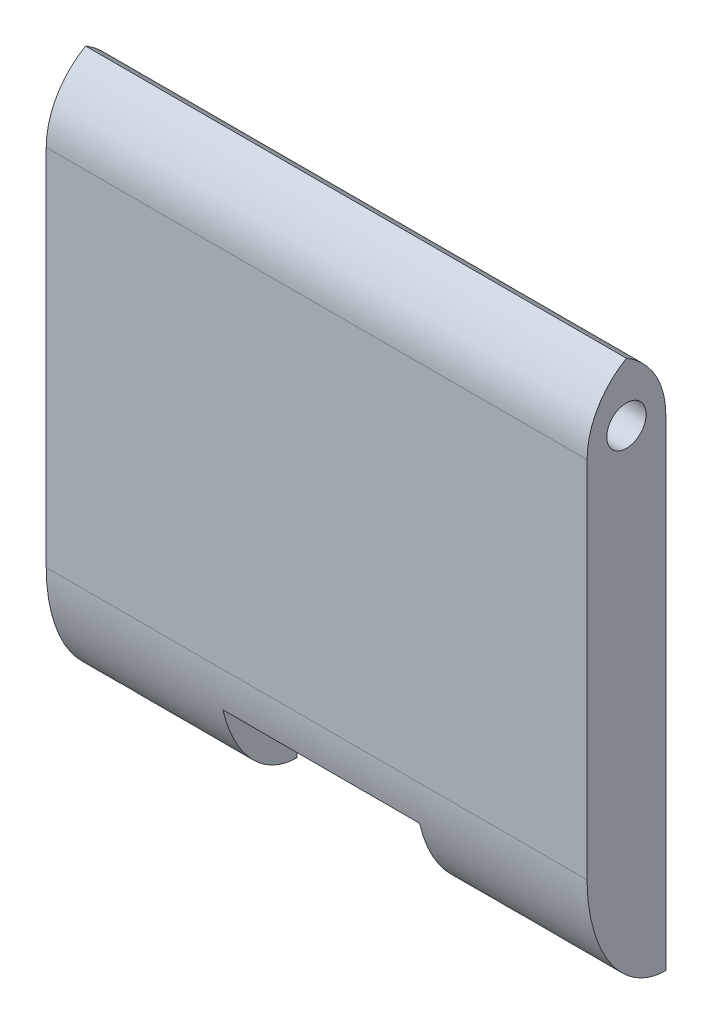
ISO-10303-21;
HEADER;
FILE_DESCRIPTION(('STEP AP214'),'2;1');
FILE_NAME('part.step','',(''),(''),'','','');
FILE_SCHEMA(('AUTOMOTIVE_DESIGN { 1 0 10303 214 1 1 1 1 }'));
ENDSEC;
DATA;
#1=APPLICATION_CONTEXT('core data for automotive mechanical design processes');
#2=APPLICATION_PROTOCOL_DEFINITION('international standard','automotive_design',2000,#1);
#3=PRODUCT_CONTEXT('',#1,'mechanical');
#4=PRODUCT('Part','Part','',(#3));
#5=PRODUCT_RELATED_PRODUCT_CATEGORY('part','',(#4));
#6=PRODUCT_DEFINITION_FORMATION('','',#4);
#7=PRODUCT_DEFINITION_CONTEXT('part definition',#1,'design');
#8=PRODUCT_DEFINITION('design','',#6,#7);
#9=PRODUCT_DEFINITION_SHAPE('','',#8);
#10=(LENGTH_UNIT() NAMED_UNIT(*) SI_UNIT(.MILLI.,.METRE.));
#11=(NAMED_UNIT(*) PLANE_ANGLE_UNIT() SI_UNIT($,.RADIAN.));
#12=(NAMED_UNIT(*) SI_UNIT($,.STERADIAN.) SOLID_ANGLE_UNIT());
#13=UNCERTAINTY_MEASURE_WITH_UNIT(LENGTH_MEASURE(1.E-05),#10,'distance_accuracy_value','');
#14=(GEOMETRIC_REPRESENTATION_CONTEXT(3) GLOBAL_UNCERTAINTY_ASSIGNED_CONTEXT((#13)) GLOBAL_UNIT_ASSIGNED_CONTEXT((#10,
#11,#12)) REPRESENTATION_CONTEXT('',''));
#15=CARTESIAN_POINT('',(0.,0.,0.));
#16=DIRECTION('',(0.,0.,1.));
#17=DIRECTION('',(1.,0.,0.));
#18=AXIS2_PLACEMENT_3D('',#15,#16,#17);
#19=CARTESIAN_POINT('',(10.,0.,8.));
#20=DIRECTION('',(-1.,0.,0.));
#21=DIRECTION('',(0.,0.,1.));
#22=AXIS2_PLACEMENT_3D('',#19,#20,#21);
#23=PLANE('',#22);
#24=DIRECTION('',(0.,1.,0.));
#25=VECTOR('',#24,1.);
#26=CARTESIAN_POINT('',(10.,0.,0.));
#27=LINE('',#26,#25);
#28=CARTESIAN_POINT('',(10.,-28.5,0.));
#29=VERTEX_POINT('',#28);
#30=CARTESIAN_POINT('',(10.,-20.5,0.));
#31=VERTEX_POINT('',#30);
#32=EDGE_CURVE('E126',#29,#31,#27,.T.);
#33=ORIENTED_EDGE('',*,*,#32,.F.);
#34=CARTESIAN_POINT('',(10.,-16.5,8.));
#35=CARTESIAN_POINT('',(10.,-28.5,8.));
#36=CARTESIAN_POINT('',(10.,-28.5,0.));
#37=(BOUNDED_CURVE() B_SPLINE_CURVE(2,(#34,#35,#36),.UNSPECIFIED.,.F.,
.F.) B_SPLINE_CURVE_WITH_KNOTS((3,3),(0.,1.),
.UNSPECIFIED.) CURVE() GEOMETRIC_REPRESENTATION_ITEM() RATIONAL_B_SPLINE_CURVE((1.,
0.707106781186548,1.)) REPRESENTATION_ITEM(''));
#38=CARTESIAN_POINT('',(10.,-20.5,7.54247233265651));
#39=VERTEX_POINT('',#38);
#40=EDGE_CURVE('E77',#29,#39,#37,.F.);
#41=ORIENTED_EDGE('',*,*,#40,.T.);
#42=DIRECTION('',(0.,0.,-1.));
#43=VECTOR('',#42,1.);
#44=CARTESIAN_POINT('',(10.,-20.5,8.));
#45=LINE('',#44,#43);
#46=EDGE_CURVE('E135',#39,#31,#45,.T.);
#47=ORIENTED_EDGE('',*,*,#46,.T.);
#48=EDGE_LOOP('',(#33,#41,#47));
#49=FACE_BOUND('',#48,.T.);
#50=ADVANCED_FACE('F46',(#49),#23,.T.);
#51=CARTESIAN_POINT('',(27.5,0.,8.));
#52=DIRECTION('',(-1.,0.,0.));
#53=DIRECTION('',(0.,0.,1.));
#54=AXIS2_PLACEMENT_3D('',#51,#52,#53);
#55=PLANE('',#54);
#56=CARTESIAN_POINT('',(27.5,21.5,4.));
#57=DIRECTION('',(1.,0.,0.));
#58=DIRECTION('',(0.,0.,-1.));
#59=AXIS2_PLACEMENT_3D('',#56,#57,#58);
#60=CIRCLE('',#59,2.);
#61=CARTESIAN_POINT('',(27.5,21.5,2.));
#62=VERTEX_POINT('',#61);
#63=EDGE_CURVE('E445',#62,#62,#60,.T.);
#64=ORIENTED_EDGE('',*,*,#63,.F.);
#65=EDGE_LOOP('',(#64));
#66=FACE_BOUND('',#65,.T.);
#67=DIRECTION('',(0.,1.,0.));
#68=VECTOR('',#67,1.);
#69=CARTESIAN_POINT('',(27.5,0.,8.));
#70=LINE('',#69,#68);
#71=CARTESIAN_POINT('',(27.5,-16.5,8.));
#72=VERTEX_POINT('',#71);
#73=CARTESIAN_POINT('',(27.5,20.5,8.));
#74=VERTEX_POINT('',#73);
#75=EDGE_CURVE('E209',#72,#74,#70,.T.);
#76=ORIENTED_EDGE('',*,*,#75,.F.);
#77=CARTESIAN_POINT('',(27.5,-28.5,0.));
#78=CARTESIAN_POINT('',(27.5,-28.5,8.));
#79=CARTESIAN_POINT('',(27.5,-16.5,8.));
#80=(BOUNDED_CURVE() B_SPLINE_CURVE(2,(#77,#78,#79),.UNSPECIFIED.,.F.,
.F.) B_SPLINE_CURVE_WITH_KNOTS((3,3),(0.,1.),
.UNSPECIFIED.) CURVE() GEOMETRIC_REPRESENTATION_ITEM() RATIONAL_B_SPLINE_CURVE((1.,
0.707106781186548,1.)) REPRESENTATION_ITEM(''));
#81=CARTESIAN_POINT('',(27.5,-28.5,0.));
#82=VERTEX_POINT('',#81);
#83=EDGE_CURVE('E144',#72,#82,#80,.F.);
#84=ORIENTED_EDGE('',*,*,#83,.T.);
#85=DIRECTION('',(0.,1.,0.));
#86=VECTOR('',#85,1.);
#87=CARTESIAN_POINT('',(27.5,0.,0.));
#88=LINE('',#87,#86);
#89=CARTESIAN_POINT('',(27.5,20.5,0.));
#90=VERTEX_POINT('',#89);
#91=EDGE_CURVE('E128',#82,#90,#88,.T.);
#92=ORIENTED_EDGE('',*,*,#91,.T.);
#93=CARTESIAN_POINT('',(27.5,20.5,8.));
#94=DIRECTION('',(-1.,0.,0.));
#95=DIRECTION('',(0.,0.,1.));
#96=AXIS2_PLACEMENT_3D('',#93,#94,#95);
#97=CIRCLE('',#96,8.);
#98=CARTESIAN_POINT('',(27.5,27.4282032302755,4.));
#99=VERTEX_POINT('',#98);
#100=EDGE_CURVE('E269',#90,#99,#97,.F.);
#101=ORIENTED_EDGE('',*,*,#100,.T.);
#102=CARTESIAN_POINT('',(27.5,20.5,0.));
#103=DIRECTION('',(-1.,0.,0.));
#104=DIRECTION('',(0.,0.,1.));
#105=AXIS2_PLACEMENT_3D('',#102,#103,#104);
#106=CIRCLE('',#105,8.);
#107=EDGE_CURVE('E279',#99,#74,#106,.F.);
#108=ORIENTED_EDGE('',*,*,#107,.T.);
#109=EDGE_LOOP('',(#76,#84,#92,#101,#108));
#110=FACE_BOUND('',#109,.T.);
#111=ADVANCED_FACE('F248',(#66,#110),#55,.F.);
#112=CARTESIAN_POINT('',(-27.5,0.,8.));
#113=DIRECTION('',(-1.,0.,0.));
#114=DIRECTION('',(0.,0.,1.));
#115=AXIS2_PLACEMENT_3D('',#112,#113,#114);
#116=PLANE('',#115);
#117=CARTESIAN_POINT('',(-27.5,21.5,4.));
#118=DIRECTION('',(1.,0.,0.));
#119=DIRECTION('',(0.,0.,-1.));
#120=AXIS2_PLACEMENT_3D('',#117,#118,#119);
#121=CIRCLE('',#120,2.);
#122=CARTESIAN_POINT('',(-27.5,21.5,2.));
#123=VERTEX_POINT('',#122);
#124=EDGE_CURVE('E138',#123,#123,#121,.T.);
#125=ORIENTED_EDGE('',*,*,#124,.T.);
#126=EDGE_LOOP('',(#125));
#127=FACE_BOUND('',#126,.T.);
#128=DIRECTION('',(0.,1.,0.));
#129=VECTOR('',#128,1.);
#130=CARTESIAN_POINT('',(-27.5,0.,0.));
#131=LINE('',#130,#129);
#132=CARTESIAN_POINT('',(-27.5,-28.5,0.));
#133=VERTEX_POINT('',#132);
#134=CARTESIAN_POINT('',(-27.5,20.5,0.));
#135=VERTEX_POINT('',#134);
#136=EDGE_CURVE('E199',#133,#135,#131,.T.);
#137=ORIENTED_EDGE('',*,*,#136,.F.);
#138=CARTESIAN_POINT('',(-27.5,-16.5,8.));
#139=CARTESIAN_POINT('',(-27.5,-28.5,8.));
#140=CARTESIAN_POINT('',(-27.5,-28.5,0.));
#141=(BOUNDED_CURVE() B_SPLINE_CURVE(2,(#138,#139,#140),.UNSPECIFIED.,.F.,
.F.) B_SPLINE_CURVE_WITH_KNOTS((3,3),(0.,1.),
.UNSPECIFIED.) CURVE() GEOMETRIC_REPRESENTATION_ITEM() RATIONAL_B_SPLINE_CURVE((1.,
0.707106781186548,1.)) REPRESENTATION_ITEM(''));
#142=CARTESIAN_POINT('',(-27.5,-16.5,8.));
#143=VERTEX_POINT('',#142);
#144=EDGE_CURVE('E185',#133,#143,#141,.F.);
#145=ORIENTED_EDGE('',*,*,#144,.T.);
#146=DIRECTION('',(0.,1.,0.));
#147=VECTOR('',#146,1.);
#148=CARTESIAN_POINT('',(-27.5,0.,8.));
#149=LINE('',#148,#147);
#150=CARTESIAN_POINT('',(-27.5,20.5,8.));
#151=VERTEX_POINT('',#150);
#152=EDGE_CURVE('E197',#143,#151,#149,.T.);
#153=ORIENTED_EDGE('',*,*,#152,.T.);
#154=CARTESIAN_POINT('',(-27.5,20.5,0.));
#155=DIRECTION('',(-1.,0.,0.));
#156=DIRECTION('',(0.,0.,1.));
#157=AXIS2_PLACEMENT_3D('',#154,#155,#156);
#158=CIRCLE('',#157,8.);
#159=CARTESIAN_POINT('',(-27.5,27.4282032302755,4.));
#160=VERTEX_POINT('',#159);
#161=EDGE_CURVE('E271',#151,#160,#158,.T.);
#162=ORIENTED_EDGE('',*,*,#161,.T.);
#163=CARTESIAN_POINT('',(-27.5,20.5,8.));
#164=DIRECTION('',(-1.,0.,0.));
#165=DIRECTION('',(0.,0.,1.));
#166=AXIS2_PLACEMENT_3D('',#163,#164,#165);
#167=CIRCLE('',#166,8.);
#168=EDGE_CURVE('E267',#160,#135,#167,.T.);
#169=ORIENTED_EDGE('',*,*,#168,.T.);
#170=EDGE_LOOP('',(#137,#145,#153,#162,#169));
#171=FACE_BOUND('',#170,.T.);
#172=ADVANCED_FACE('F196',(#127,#171),#116,.T.);
#173=CARTESIAN_POINT('',(-10.,0.,8.));
#174=DIRECTION('',(-1.,0.,0.));
#175=DIRECTION('',(0.,0.,1.));
#176=AXIS2_PLACEMENT_3D('',#173,#174,#175);
#177=PLANE('',#176);
#178=DIRECTION('',(0.,0.,-1.));
#179=VECTOR('',#178,1.);
#180=CARTESIAN_POINT('',(-10.,-20.5,8.));
#181=LINE('',#180,#179);
#182=CARTESIAN_POINT('',(-10.,-20.5,7.54247233265651));
#183=VERTEX_POINT('',#182);
#184=CARTESIAN_POINT('',(-10.,-20.5,0.));
#185=VERTEX_POINT('',#184);
#186=EDGE_CURVE('E212',#183,#185,#181,.T.);
#187=ORIENTED_EDGE('',*,*,#186,.F.);
#188=CARTESIAN_POINT('',(-9.99999999999999,-28.5,0.));
#189=CARTESIAN_POINT('',(-9.99999999999999,-28.5,8.));
#190=CARTESIAN_POINT('',(-9.99999999999999,-16.5,8.));
#191=(BOUNDED_CURVE() B_SPLINE_CURVE(2,(#188,#189,#190),.UNSPECIFIED.,.F.,
.F.) B_SPLINE_CURVE_WITH_KNOTS((3,3),(0.,1.),
.UNSPECIFIED.) CURVE() GEOMETRIC_REPRESENTATION_ITEM() RATIONAL_B_SPLINE_CURVE((1.,
0.707106781186548,1.)) REPRESENTATION_ITEM(''));
#192=CARTESIAN_POINT('',(-10.,-28.5,0.));
#193=VERTEX_POINT('',#192);
#194=EDGE_CURVE('E12',#183,#193,#191,.F.);
#195=ORIENTED_EDGE('',*,*,#194,.T.);
#196=DIRECTION('',(0.,1.,0.));
#197=VECTOR('',#196,1.);
#198=CARTESIAN_POINT('',(-10.,0.,0.));
#199=LINE('',#198,#197);
#200=EDGE_CURVE('E226',#193,#185,#199,.T.);
#201=ORIENTED_EDGE('',*,*,#200,.T.);
#202=EDGE_LOOP('',(#187,#195,#201));
#203=FACE_BOUND('',#202,.T.);
#204=ADVANCED_FACE('F303',(#203),#177,.F.);
#205=CARTESIAN_POINT('',(0.,-20.5,8.));
#206=DIRECTION('',(0.,1.,0.));
#207=DIRECTION('',(0.,0.,1.));
#208=AXIS2_PLACEMENT_3D('',#205,#206,#207);
#209=PLANE('',#208);
#210=ORIENTED_EDGE('',*,*,#46,.F.);
#211=CARTESIAN_POINT('',(-30.25,-20.5,7.54247233265651));
#212=CARTESIAN_POINT('',(-10.0833333333333,-20.5,7.54247233265651));
#213=CARTESIAN_POINT('',(10.0833333333333,-20.5,7.54247233265651));
#214=CARTESIAN_POINT('',(30.25,-20.5,7.54247233265651));
#215=(BOUNDED_CURVE() B_SPLINE_CURVE(3,(#211,#212,#213,#214),.UNSPECIFIED.,.F.,
.F.) B_SPLINE_CURVE_WITH_KNOTS((4,4),(-0.03025,0.03025),
.UNSPECIFIED.) CURVE() GEOMETRIC_REPRESENTATION_ITEM() RATIONAL_B_SPLINE_CURVE((0.897358423438309,
0.897358423438309,0.897358423438309,0.897358423438309)) REPRESENTATION_ITEM(''));
#216=EDGE_CURVE('E62',#39,#183,#215,.F.);
#217=ORIENTED_EDGE('',*,*,#216,.T.);
#218=ORIENTED_EDGE('',*,*,#186,.T.);
#219=DIRECTION('',(1.,0.,0.));
#220=VECTOR('',#219,1.);
#221=CARTESIAN_POINT('',(0.,-20.5,0.));
#222=LINE('',#221,#220);
#223=EDGE_CURVE('E214',#185,#31,#222,.T.);
#224=ORIENTED_EDGE('',*,*,#223,.T.);
#225=EDGE_LOOP('',(#210,#217,#218,#224));
#226=FACE_BOUND('',#225,.T.);
#227=ADVANCED_FACE('F294',(#226),#209,.F.);
#228=CARTESIAN_POINT('',(0.,0.,8.));
#229=DIRECTION('',(0.,0.,1.));
#230=DIRECTION('',(1.,0.,0.));
#231=AXIS2_PLACEMENT_3D('',#228,#229,#230);
#232=PLANE('',#231);
#233=ORIENTED_EDGE('',*,*,#152,.F.);
#234=CARTESIAN_POINT('',(30.25,-16.5,8.));
#235=CARTESIAN_POINT('',(10.0833333333333,-16.5,8.));
#236=CARTESIAN_POINT('',(-10.0833333333333,-16.5,8.));
#237=CARTESIAN_POINT('',(-30.25,-16.5,8.));
#238=(BOUNDED_CURVE() B_SPLINE_CURVE(3,(#234,#235,#236,#237),.UNSPECIFIED.,.F.,
.F.) B_SPLINE_CURVE_WITH_KNOTS((4,4),(-0.03025,0.03025),
.UNSPECIFIED.) CURVE() GEOMETRIC_REPRESENTATION_ITEM() RATIONAL_B_SPLINE_CURVE((1.,1.,1.,1.)) REPRESENTATION_ITEM(''));
#239=EDGE_CURVE('E175',#143,#72,#238,.F.);
#240=ORIENTED_EDGE('',*,*,#239,.T.);
#241=ORIENTED_EDGE('',*,*,#75,.T.);
#242=DIRECTION('',(1.,0.,0.));
#243=VECTOR('',#242,1.);
#244=CARTESIAN_POINT('',(0.,20.5,8.));
#245=LINE('',#244,#243);
#246=EDGE_CURVE('E207',#74,#151,#245,.F.);
#247=ORIENTED_EDGE('',*,*,#246,.T.);
#248=EDGE_LOOP('',(#233,#240,#241,#247));
#249=FACE_BOUND('',#248,.T.);
#250=ADVANCED_FACE('F205',(#249),#232,.T.);
#251=CARTESIAN_POINT('',(0.,0.,0.));
#252=DIRECTION('',(0.,0.,1.));
#253=DIRECTION('',(1.,0.,0.));
#254=AXIS2_PLACEMENT_3D('',#251,#252,#253);
#255=PLANE('',#254);
#256=ORIENTED_EDGE('',*,*,#136,.T.);
#257=DIRECTION('',(1.,0.,0.));
#258=VECTOR('',#257,1.);
#259=CARTESIAN_POINT('',(27.5,20.5,0.));
#260=LINE('',#259,#258);
#261=EDGE_CURVE('E192',#135,#90,#260,.T.);
#262=ORIENTED_EDGE('',*,*,#261,.T.);
#263=ORIENTED_EDGE('',*,*,#91,.F.);
#264=CARTESIAN_POINT('',(-30.25,-28.5,0.));
#265=CARTESIAN_POINT('',(-10.0833333333333,-28.5,0.));
#266=CARTESIAN_POINT('',(10.0833333333333,-28.5,0.));
#267=CARTESIAN_POINT('',(30.25,-28.5,0.));
#268=(BOUNDED_CURVE() B_SPLINE_CURVE(3,(#264,#265,#266,#267),.UNSPECIFIED.,.F.,
.F.) B_SPLINE_CURVE_WITH_KNOTS((4,4),(-0.03025,0.03025),
.UNSPECIFIED.) CURVE() GEOMETRIC_REPRESENTATION_ITEM() RATIONAL_B_SPLINE_CURVE((1.,1.,1.,1.)) REPRESENTATION_ITEM(''));
#269=EDGE_CURVE('E121',#29,#82,#268,.T.);
#270=ORIENTED_EDGE('',*,*,#269,.F.);
#271=ORIENTED_EDGE('',*,*,#32,.T.);
#272=ORIENTED_EDGE('',*,*,#223,.F.);
#273=ORIENTED_EDGE('',*,*,#200,.F.);
#274=CARTESIAN_POINT('',(-30.25,-28.5,0.));
#275=CARTESIAN_POINT('',(-10.0833333333333,-28.5,0.));
#276=CARTESIAN_POINT('',(10.0833333333333,-28.5,0.));
#277=CARTESIAN_POINT('',(30.25,-28.5,0.));
#278=(BOUNDED_CURVE() B_SPLINE_CURVE(3,(#274,#275,#276,#277),.UNSPECIFIED.,.F.,
.F.) B_SPLINE_CURVE_WITH_KNOTS((4,4),(-0.03025,0.03025),
.UNSPECIFIED.) CURVE() GEOMETRIC_REPRESENTATION_ITEM() RATIONAL_B_SPLINE_CURVE((1.,1.,1.,1.)) REPRESENTATION_ITEM(''));
#279=EDGE_CURVE('E320',#133,#193,#278,.T.);
#280=ORIENTED_EDGE('',*,*,#279,.F.);
#281=EDGE_LOOP('',(#256,#262,#263,#270,#271,#272,#273,#280));
#282=FACE_BOUND('',#281,.T.);
#283=ADVANCED_FACE('F124',(#282),#255,.F.);
#284=CARTESIAN_POINT('',(-27.5,21.5,4.));
#285=DIRECTION('',(1.,0.,0.));
#286=DIRECTION('',(0.,0.,-1.));
#287=AXIS2_PLACEMENT_3D('',#284,#285,#286);
#288=CYLINDRICAL_SURFACE('',#287,2.);
#289=ORIENTED_EDGE('',*,*,#124,.F.);
#290=EDGE_LOOP('',(#289));
#291=FACE_BOUND('',#290,.T.);
#292=ORIENTED_EDGE('',*,*,#63,.T.);
#293=EDGE_LOOP('',(#292));
#294=FACE_BOUND('',#293,.T.);
#295=ADVANCED_FACE('F256',(#291,#294),#288,.F.);
#296=CARTESIAN_POINT('',(0.,20.5,8.));
#297=DIRECTION('',(-1.,0.,0.));
#298=DIRECTION('',(0.,0.,1.));
#299=AXIS2_PLACEMENT_3D('',#296,#297,#298);
#300=CYLINDRICAL_SURFACE('',#299,8.);
#301=ORIENTED_EDGE('',*,*,#261,.F.);
#302=ORIENTED_EDGE('',*,*,#168,.F.);
#303=DIRECTION('',(-1.,0.,0.));
#304=VECTOR('',#303,1.);
#305=CARTESIAN_POINT('',(0.,27.4282032302755,4.));
#306=LINE('',#305,#304);
#307=EDGE_CURVE('E201',#99,#160,#306,.T.);
#308=ORIENTED_EDGE('',*,*,#307,.F.);
#309=ORIENTED_EDGE('',*,*,#100,.F.);
#310=EDGE_LOOP('',(#301,#302,#308,#309));
#311=FACE_BOUND('',#310,.T.);
#312=ADVANCED_FACE('F253',(#311),#300,.T.);
#313=CARTESIAN_POINT('',(0.,20.5,0.));
#314=DIRECTION('',(1.,0.,0.));
#315=DIRECTION('',(0.,0.,-1.));
#316=AXIS2_PLACEMENT_3D('',#313,#314,#315);
#317=CYLINDRICAL_SURFACE('',#316,8.);
#318=ORIENTED_EDGE('',*,*,#161,.F.);
#319=ORIENTED_EDGE('',*,*,#246,.F.);
#320=ORIENTED_EDGE('',*,*,#107,.F.);
#321=ORIENTED_EDGE('',*,*,#307,.T.);
#322=EDGE_LOOP('',(#318,#319,#320,#321));
#323=FACE_BOUND('',#322,.T.);
#324=ADVANCED_FACE('F251',(#323),#317,.T.);
#325=CARTESIAN_POINT('',(30.25,-28.5,0.));
#326=CARTESIAN_POINT('',(10.0833333333333,-28.5,0.));
#327=CARTESIAN_POINT('',(-10.0833333333333,-28.5,0.));
#328=CARTESIAN_POINT('',(-30.25,-28.5,0.));
#329=CARTESIAN_POINT('',(30.25,-28.5,8.));
#330=CARTESIAN_POINT('',(10.0833333333333,-28.5,8.));
#331=CARTESIAN_POINT('',(-10.0833333333333,-28.5,8.));
#332=CARTESIAN_POINT('',(-30.25,-28.5,8.));
#333=CARTESIAN_POINT('',(30.25,-16.5,8.));
#334=CARTESIAN_POINT('',(10.0833333333333,-16.5,8.));
#335=CARTESIAN_POINT('',(-10.0833333333333,-16.5,8.));
#336=CARTESIAN_POINT('',(-30.25,-16.5,8.));
#337=(BOUNDED_SURFACE() B_SPLINE_SURFACE(2,3,((#325,#326,#327,#328),(#329,#330,#331,#332),(#333,
#334,#335,#336)),.UNSPECIFIED.,.F.,.F.,.F.) B_SPLINE_SURFACE_WITH_KNOTS((3,3),(4,4),(0.,1.),
(-0.03025,0.03025),
.UNSPECIFIED.) GEOMETRIC_REPRESENTATION_ITEM() RATIONAL_B_SPLINE_SURFACE(((1.,1.,1.,1.),
(0.707106781186548,0.707106781186548,0.707106781186548,0.707106781186548),(1.,1.,1.,1.))) REPRESENTATION_ITEM('') SURFACE());
#338=ORIENTED_EDGE('',*,*,#83,.F.);
#339=ORIENTED_EDGE('',*,*,#239,.F.);
#340=ORIENTED_EDGE('',*,*,#144,.F.);
#341=ORIENTED_EDGE('',*,*,#279,.T.);
#342=ORIENTED_EDGE('',*,*,#194,.F.);
#343=ORIENTED_EDGE('',*,*,#216,.F.);
#344=ORIENTED_EDGE('',*,*,#40,.F.);
#345=ORIENTED_EDGE('',*,*,#269,.T.);
#346=EDGE_LOOP('',(#338,#339,#340,#341,#342,#343,#344,#345));
#347=FACE_BOUND('',#346,.T.);
#348=ADVANCED_FACE('F49',(#347),#337,.T.);
#349=CLOSED_SHELL('',(#50,#111,#172,#204,#227,#250,#283,#295,#312,#324,#348));
#350=MANIFOLD_SOLID_BREP('B2',#349);
#351=ADVANCED_BREP_SHAPE_REPRESENTATION('',(#18,#350),#14);
#352=SHAPE_DEFINITION_REPRESENTATION(#9,#351);
ENDSEC;
END-ISO-10303-21;
